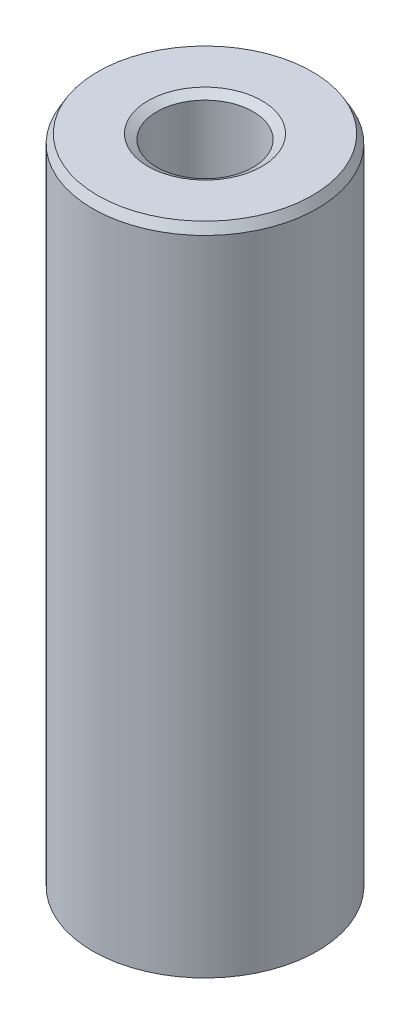
ISO-10303-21;
HEADER;
FILE_DESCRIPTION(('STEP AP214'),'2;1');
FILE_NAME('part.step','',(''),(''),'','','');
FILE_SCHEMA(('AUTOMOTIVE_DESIGN { 1 0 10303 214 1 1 1 1 }'));
ENDSEC;
DATA;
#1=APPLICATION_CONTEXT('core data for automotive mechanical design processes');
#2=APPLICATION_PROTOCOL_DEFINITION('international standard','automotive_design',2000,#1);
#3=PRODUCT_CONTEXT('',#1,'mechanical');
#4=PRODUCT('Part','Part','',(#3));
#5=PRODUCT_RELATED_PRODUCT_CATEGORY('part','',(#4));
#6=PRODUCT_DEFINITION_FORMATION('','',#4);
#7=PRODUCT_DEFINITION_CONTEXT('part definition',#1,'design');
#8=PRODUCT_DEFINITION('design','',#6,#7);
#9=PRODUCT_DEFINITION_SHAPE('','',#8);
#10=(LENGTH_UNIT() NAMED_UNIT(*) SI_UNIT(.MILLI.,.METRE.));
#11=(NAMED_UNIT(*) PLANE_ANGLE_UNIT() SI_UNIT($,.RADIAN.));
#12=(NAMED_UNIT(*) SI_UNIT($,.STERADIAN.) SOLID_ANGLE_UNIT());
#13=UNCERTAINTY_MEASURE_WITH_UNIT(LENGTH_MEASURE(1.E-05),#10,'distance_accuracy_value','');
#14=(GEOMETRIC_REPRESENTATION_CONTEXT(3) GLOBAL_UNCERTAINTY_ASSIGNED_CONTEXT((#13)) GLOBAL_UNIT_ASSIGNED_CONTEXT((#10,
#11,#12)) REPRESENTATION_CONTEXT('',''));
#15=CARTESIAN_POINT('',(0.,0.,0.));
#16=DIRECTION('',(0.,0.,1.));
#17=DIRECTION('',(1.,0.,0.));
#18=AXIS2_PLACEMENT_3D('',#15,#16,#17);
#19=CARTESIAN_POINT('',(0.,190.020085053215,0.));
#20=DIRECTION('',(0.,-1.,0.));
#21=DIRECTION('',(0.,0.,-1.));
#22=AXIS2_PLACEMENT_3D('',#19,#20,#21);
#23=CYLINDRICAL_SURFACE('',#22,32.5);
#24=CARTESIAN_POINT('',(0.,1.46967511613769,0.));
#25=DIRECTION('',(0.,1.,0.));
#26=DIRECTION('',(0.,0.,1.));
#27=AXIS2_PLACEMENT_3D('',#24,#25,#26);
#28=CIRCLE('',#27,32.5);
#29=CARTESIAN_POINT('',(0.,1.46967511613769,32.5));
#30=VERTEX_POINT('',#29);
#31=EDGE_CURVE('E10',#30,#30,#28,.T.);
#32=ORIENTED_EDGE('',*,*,#31,.T.);
#33=EDGE_LOOP('',(#32));
#34=FACE_BOUND('',#33,.T.);
#35=CARTESIAN_POINT('',(0.,187.474533081445,0.));
#36=DIRECTION('',(0.,1.,0.));
#37=DIRECTION('',(0.,0.,1.));
#38=AXIS2_PLACEMENT_3D('',#35,#36,#37);
#39=CIRCLE('',#38,32.5);
#40=CARTESIAN_POINT('',(0.,187.474533081445,32.5));
#41=VERTEX_POINT('',#40);
#42=EDGE_CURVE('E50',#41,#41,#39,.F.);
#43=ORIENTED_EDGE('',*,*,#42,.T.);
#44=EDGE_LOOP('',(#43));
#45=FACE_BOUND('',#44,.T.);
#46=ADVANCED_FACE('F39',(#34,#45),#23,.T.);
#47=CARTESIAN_POINT('',(0.,190.020085053215,0.));
#48=DIRECTION('',(0.,1.,0.));
#49=DIRECTION('',(0.,0.,1.));
#50=AXIS2_PLACEMENT_3D('',#47,#48,#49);
#51=PLANE('',#50);
#52=CARTESIAN_POINT('',(0.,190.020085053215,0.));
#53=DIRECTION('',(0.,1.,0.));
#54=DIRECTION('',(0.,0.,1.));
#55=AXIS2_PLACEMENT_3D('',#52,#53,#54);
#56=CIRCLE('',#55,16.4829220363239);
#57=CARTESIAN_POINT('',(0.,190.020085053215,16.4829220363239));
#58=VERTEX_POINT('',#57);
#59=EDGE_CURVE('E58',#58,#58,#56,.F.);
#60=ORIENTED_EDGE('',*,*,#59,.T.);
#61=EDGE_LOOP('',(#60));
#62=FACE_BOUND('',#61,.T.);
#63=CARTESIAN_POINT('',(0.,190.020085053215,0.));
#64=DIRECTION('',(0.,1.,0.));
#65=DIRECTION('',(0.,0.,1.));
#66=AXIS2_PLACEMENT_3D('',#63,#64,#65);
#67=CIRCLE('',#66,31.0303248838623);
#68=CARTESIAN_POINT('',(0.,190.020085053215,31.0303248838623));
#69=VERTEX_POINT('',#68);
#70=EDGE_CURVE('E61',#69,#69,#67,.T.);
#71=ORIENTED_EDGE('',*,*,#70,.T.);
#72=EDGE_LOOP('',(#71));
#73=FACE_BOUND('',#72,.T.);
#74=ADVANCED_FACE('F88',(#62,#73),#51,.T.);
#75=CARTESIAN_POINT('',(0.,0.,0.));
#76=DIRECTION('',(0.,1.,0.));
#77=DIRECTION('',(0.,0.,1.));
#78=AXIS2_PLACEMENT_3D('',#75,#76,#77);
#79=PLANE('',#78);
#80=CARTESIAN_POINT('',(0.,0.,0.));
#81=DIRECTION('',(0.,1.,0.));
#82=DIRECTION('',(0.,0.,1.));
#83=AXIS2_PLACEMENT_3D('',#80,#81,#82);
#84=CIRCLE('',#83,15.4070451806915);
#85=CARTESIAN_POINT('',(0.,0.,15.4070451806915));
#86=VERTEX_POINT('',#85);
#87=EDGE_CURVE('E51',#86,#86,#84,.T.);
#88=ORIENTED_EDGE('',*,*,#87,.T.);
#89=EDGE_LOOP('',(#88));
#90=FACE_BOUND('',#89,.T.);
#91=CARTESIAN_POINT('',(0.,0.,0.));
#92=DIRECTION('',(0.,1.,0.));
#93=DIRECTION('',(0.,0.,1.));
#94=AXIS2_PLACEMENT_3D('',#91,#92,#93);
#95=CIRCLE('',#94,29.9544480282298);
#96=CARTESIAN_POINT('',(0.,0.,29.9544480282298));
#97=VERTEX_POINT('',#96);
#98=EDGE_CURVE('E54',#97,#97,#95,.F.);
#99=ORIENTED_EDGE('',*,*,#98,.T.);
#100=EDGE_LOOP('',(#99));
#101=FACE_BOUND('',#100,.T.);
#102=ADVANCED_FACE('F83',(#90,#101),#79,.F.);
#103=CARTESIAN_POINT('',(0.,190.020085053215,0.));
#104=DIRECTION('',(0.,-1.,0.));
#105=DIRECTION('',(0.,0.,-1.));
#106=AXIS2_PLACEMENT_3D('',#103,#104,#105);
#107=CYLINDRICAL_SURFACE('',#106,13.9373700645538);
#108=CARTESIAN_POINT('',(0.,188.550409937078,0.));
#109=DIRECTION('',(0.,1.,0.));
#110=DIRECTION('',(0.,0.,1.));
#111=AXIS2_PLACEMENT_3D('',#108,#109,#110);
#112=CIRCLE('',#111,13.9373700645538);
#113=CARTESIAN_POINT('',(0.,188.550409937078,13.9373700645538));
#114=VERTEX_POINT('',#113);
#115=EDGE_CURVE('E67',#114,#114,#112,.T.);
#116=ORIENTED_EDGE('',*,*,#115,.T.);
#117=EDGE_LOOP('',(#116));
#118=FACE_BOUND('',#117,.T.);
#119=CARTESIAN_POINT('',(0.,2.5455519717702,0.));
#120=DIRECTION('',(0.,1.,0.));
#121=DIRECTION('',(0.,0.,1.));
#122=AXIS2_PLACEMENT_3D('',#119,#120,#121);
#123=CIRCLE('',#122,13.9373700645538);
#124=CARTESIAN_POINT('',(0.,2.5455519717702,13.9373700645538));
#125=VERTEX_POINT('',#124);
#126=EDGE_CURVE('E69',#125,#125,#123,.F.);
#127=ORIENTED_EDGE('',*,*,#126,.T.);
#128=EDGE_LOOP('',(#127));
#129=FACE_BOUND('',#128,.T.);
#130=ADVANCED_FACE('F71',(#118,#129),#107,.F.);
#131=CARTESIAN_POINT('',(0.,188.550409937078,0.));
#132=DIRECTION('',(0.,1.,0.));
#133=DIRECTION('',(0.,0.,1.));
#134=AXIS2_PLACEMENT_3D('',#131,#132,#133);
#135=CONICAL_SURFACE('',#134,13.9373700645538,1.04719755119659);
#136=ORIENTED_EDGE('',*,*,#59,.F.);
#137=EDGE_LOOP('',(#136));
#138=FACE_BOUND('',#137,.T.);
#139=ORIENTED_EDGE('',*,*,#115,.F.);
#140=EDGE_LOOP('',(#139));
#141=FACE_BOUND('',#140,.T.);
#142=ADVANCED_FACE('F77',(#138,#141),#135,.F.);
#143=CARTESIAN_POINT('',(0.,0.,0.));
#144=DIRECTION('',(0.,-1.,0.));
#145=DIRECTION('',(0.,0.,-1.));
#146=AXIS2_PLACEMENT_3D('',#143,#144,#145);
#147=CONICAL_SURFACE('',#146,15.4070451806915,0.523598775598299);
#148=ORIENTED_EDGE('',*,*,#126,.F.);
#149=EDGE_LOOP('',(#148));
#150=FACE_BOUND('',#149,.T.);
#151=ORIENTED_EDGE('',*,*,#87,.F.);
#152=EDGE_LOOP('',(#151));
#153=FACE_BOUND('',#152,.T.);
#154=ADVANCED_FACE('F73',(#150,#153),#147,.F.);
#155=CARTESIAN_POINT('',(0.,1.46967511613769,0.));
#156=DIRECTION('',(0.,1.,0.));
#157=DIRECTION('',(0.,0.,1.));
#158=AXIS2_PLACEMENT_3D('',#155,#156,#157);
#159=CONICAL_SURFACE('',#158,32.5,1.0471975511966);
#160=ORIENTED_EDGE('',*,*,#98,.F.);
#161=EDGE_LOOP('',(#160));
#162=FACE_BOUND('',#161,.T.);
#163=ORIENTED_EDGE('',*,*,#31,.F.);
#164=EDGE_LOOP('',(#163));
#165=FACE_BOUND('',#164,.T.);
#166=ADVANCED_FACE('F76',(#162,#165),#159,.T.);
#167=CARTESIAN_POINT('',(0.,190.020085053215,0.));
#168=DIRECTION('',(0.,-1.,0.));
#169=DIRECTION('',(0.,0.,-1.));
#170=AXIS2_PLACEMENT_3D('',#167,#168,#169);
#171=CONICAL_SURFACE('',#170,31.0303248838623,0.523598775598292);
#172=ORIENTED_EDGE('',*,*,#42,.F.);
#173=EDGE_LOOP('',(#172));
#174=FACE_BOUND('',#173,.T.);
#175=ORIENTED_EDGE('',*,*,#70,.F.);
#176=EDGE_LOOP('',(#175));
#177=FACE_BOUND('',#176,.T.);
#178=ADVANCED_FACE('F45',(#174,#177),#171,.T.);
#179=CLOSED_SHELL('',(#46,#74,#102,#130,#142,#154,#166,#178));
#180=MANIFOLD_SOLID_BREP('B2',#179);
#181=ADVANCED_BREP_SHAPE_REPRESENTATION('',(#18,#180),#14);
#182=SHAPE_DEFINITION_REPRESENTATION(#9,#181);
ENDSEC;
END-ISO-10303-21;
